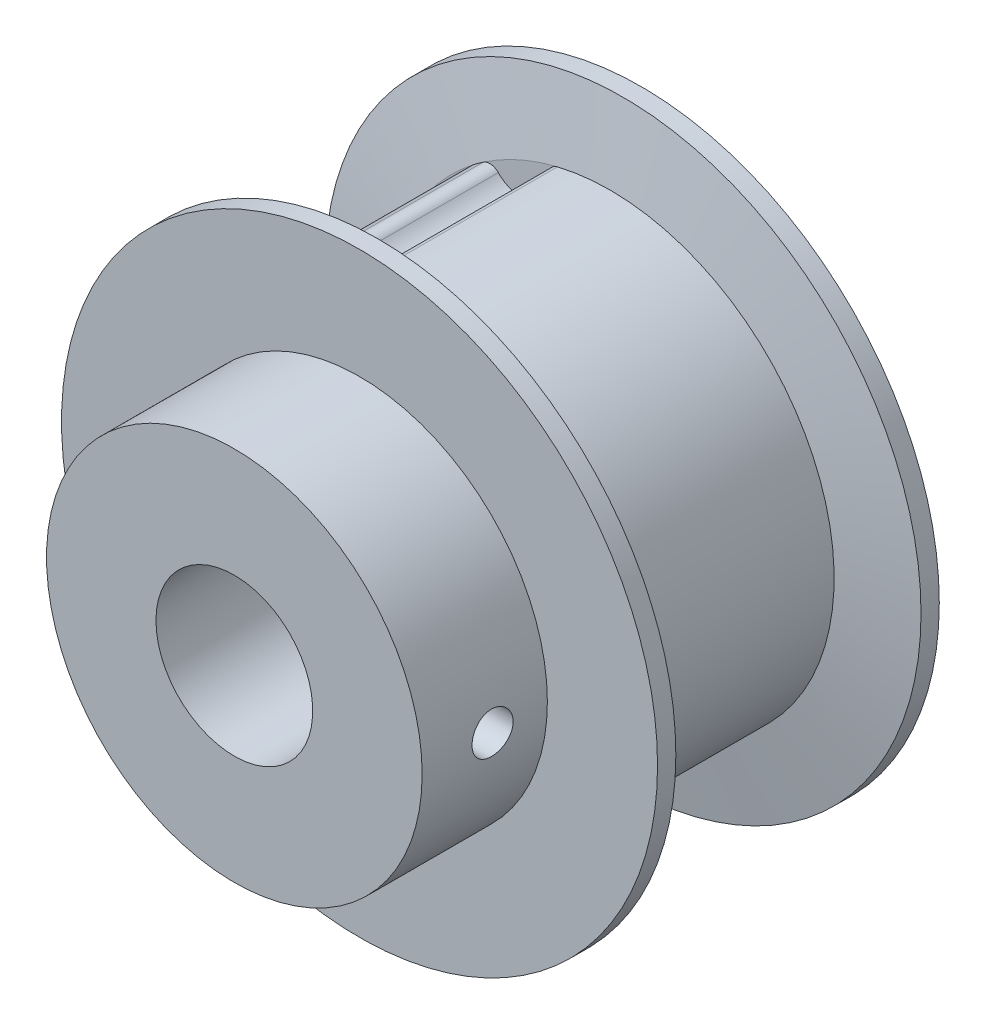
ISO-10303-21;
HEADER;
FILE_DESCRIPTION(('STEP AP214'),'2;1');
FILE_NAME('part.step','',(''),(''),'','','');
FILE_SCHEMA(('AUTOMOTIVE_DESIGN { 1 0 10303 214 1 1 1 1 }'));
ENDSEC;
DATA;
#1=APPLICATION_CONTEXT('core data for automotive mechanical design processes');
#2=APPLICATION_PROTOCOL_DEFINITION('international standard','automotive_design',2000,#1);
#3=PRODUCT_CONTEXT('',#1,'mechanical');
#4=PRODUCT('Part','Part','',(#3));
#5=PRODUCT_RELATED_PRODUCT_CATEGORY('part','',(#4));
#6=PRODUCT_DEFINITION_FORMATION('','',#4);
#7=PRODUCT_DEFINITION_CONTEXT('part definition',#1,'design');
#8=PRODUCT_DEFINITION('design','',#6,#7);
#9=PRODUCT_DEFINITION_SHAPE('','',#8);
#10=(LENGTH_UNIT() NAMED_UNIT(*) SI_UNIT(.MILLI.,.METRE.));
#11=(NAMED_UNIT(*) PLANE_ANGLE_UNIT() SI_UNIT($,.RADIAN.));
#12=(NAMED_UNIT(*) SI_UNIT($,.STERADIAN.) SOLID_ANGLE_UNIT());
#13=UNCERTAINTY_MEASURE_WITH_UNIT(LENGTH_MEASURE(1.E-05),#10,'distance_accuracy_value','');
#14=(GEOMETRIC_REPRESENTATION_CONTEXT(3) GLOBAL_UNCERTAINTY_ASSIGNED_CONTEXT((#13)) GLOBAL_UNIT_ASSIGNED_CONTEXT((#10,
#11,#12)) REPRESENTATION_CONTEXT('',''));
#15=CARTESIAN_POINT('',(0.,0.,0.));
#16=DIRECTION('',(0.,0.,1.));
#17=DIRECTION('',(1.,0.,0.));
#18=AXIS2_PLACEMENT_3D('',#15,#16,#17);
#19=CARTESIAN_POINT('',(0.,0.,-6.83854493654546));
#20=DIRECTION('',(0.,0.,1.));
#21=DIRECTION('',(1.,0.,0.));
#22=AXIS2_PLACEMENT_3D('',#19,#20,#21);
#23=CYLINDRICAL_SURFACE('',#22,11.3665);
#24=DIRECTION('',(0.,0.,1.));
#25=VECTOR('',#24,1.);
#26=CARTESIAN_POINT('',(-6.92571975920571,9.01286458718603,5.55625));
#27=LINE('',#26,#25);
#28=CARTESIAN_POINT('',(-6.92571975985629,9.0128645866861,5.55624999999923));
#29=VERTEX_POINT('',#28);
#30=CARTESIAN_POINT('',(-6.92571975985654,9.01286458668643,-5.55624999999925));
#31=VERTEX_POINT('',#30);
#32=EDGE_CURVE('E222',#29,#31,#27,.F.);
#33=ORIENTED_EDGE('',*,*,#32,.F.);
#34=CARTESIAN_POINT('',(0.,0.,5.55625));
#35=DIRECTION('',(0.,0.,1.));
#36=DIRECTION('',(1.,0.,0.));
#37=AXIS2_PLACEMENT_3D('',#34,#35,#36);
#38=CIRCLE('',#37,11.3665);
#39=CARTESIAN_POINT('',(-6.43157849157934,9.37187923293224,5.55625000000005));
#40=VERTEX_POINT('',#39);
#41=EDGE_CURVE('E240',#29,#40,#38,.F.);
#42=ORIENTED_EDGE('',*,*,#41,.T.);
#43=DIRECTION('',(0.,0.,1.));
#44=VECTOR('',#43,1.);
#45=CARTESIAN_POINT('',(-6.43157849225601,9.37187923246853,5.55625));
#46=LINE('',#45,#44);
#47=CARTESIAN_POINT('',(-6.43157849157945,9.3718792329324,-5.5562499999992));
#48=VERTEX_POINT('',#47);
#49=EDGE_CURVE('E219',#48,#40,#46,.T.);
#50=ORIENTED_EDGE('',*,*,#49,.F.);
#51=CARTESIAN_POINT('',(0.,0.,-5.55625));
#52=DIRECTION('',(0.,0.,1.));
#53=DIRECTION('',(1.,0.,0.));
#54=AXIS2_PLACEMENT_3D('',#51,#52,#53);
#55=CIRCLE('',#54,11.3665);
#56=EDGE_CURVE('E243',#48,#31,#55,.T.);
#57=ORIENTED_EDGE('',*,*,#56,.T.);
#58=EDGE_LOOP('',(#33,#42,#50,#57));
#59=FACE_BOUND('',#58,.T.);
#60=ADVANCED_FACE('F16',(#59),#23,.T.);
#61=CARTESIAN_POINT('',(0.,0.,-6.83854493654546));
#62=DIRECTION('',(0.,0.,1.));
#63=DIRECTION('',(1.,0.,0.));
#64=AXIS2_PLACEMENT_3D('',#61,#62,#63);
#65=CYLINDRICAL_SURFACE('',#64,11.3665);
#66=CARTESIAN_POINT('',(0.,0.,-5.55625));
#67=DIRECTION('',(0.,0.,1.));
#68=DIRECTION('',(1.,0.,0.));
#69=AXIS2_PLACEMENT_3D('',#66,#67,#68);
#70=CIRCLE('',#69,11.3665);
#71=CARTESIAN_POINT('',(-9.68742601496993,5.94567905747549,-5.55624999999925));
#72=VERTEX_POINT('',#71);
#73=CARTESIAN_POINT('',(-9.99282211400751,5.41671749750633,-5.55624999999916));
#74=VERTEX_POINT('',#73);
#75=EDGE_CURVE('E235',#72,#74,#70,.T.);
#76=ORIENTED_EDGE('',*,*,#75,.T.);
#77=DIRECTION('',(0.,0.,1.));
#78=VECTOR('',#77,1.);
#79=CARTESIAN_POINT('',(-9.99282211361638,5.41671749822686,5.55625));
#80=LINE('',#79,#78);
#81=CARTESIAN_POINT('',(-9.99282211400708,5.4167174975061,5.5562499999992));
#82=VERTEX_POINT('',#81);
#83=EDGE_CURVE('E211',#82,#74,#80,.F.);
#84=ORIENTED_EDGE('',*,*,#83,.F.);
#85=CARTESIAN_POINT('',(0.,0.,5.55625));
#86=DIRECTION('',(0.,0.,1.));
#87=DIRECTION('',(1.,0.,0.));
#88=AXIS2_PLACEMENT_3D('',#85,#86,#87);
#89=CIRCLE('',#88,11.3665);
#90=CARTESIAN_POINT('',(-9.68742601496977,5.94567905747539,5.55624999999923));
#91=VERTEX_POINT('',#90);
#92=EDGE_CURVE('E242',#82,#91,#89,.F.);
#93=ORIENTED_EDGE('',*,*,#92,.T.);
#94=DIRECTION('',(0.,0.,1.));
#95=VECTOR('',#94,1.);
#96=CARTESIAN_POINT('',(-9.68742601539869,5.94567905677654,5.55625));
#97=LINE('',#96,#95);
#98=EDGE_CURVE('E228',#72,#91,#97,.T.);
#99=ORIENTED_EDGE('',*,*,#98,.F.);
#100=EDGE_LOOP('',(#76,#84,#93,#99));
#101=FACE_BOUND('',#100,.T.);
#102=ADVANCED_FACE('F341',(#101),#65,.T.);
#103=CARTESIAN_POINT('',(-9.17653606159526,5.63211922404484,5.55625));
#104=DIRECTION('',(0.,0.,1.));
#105=DIRECTION('',(1.,0.,0.));
#106=AXIS2_PLACEMENT_3D('',#103,#104,#105);
#107=CYLINDRICAL_SURFACE('',#106,0.59944);
#108=CARTESIAN_POINT('',(-9.17653606159526,5.63211922404484,-5.55625));
#109=DIRECTION('',(0.,0.,1.));
#110=DIRECTION('',(1.,0.,0.));
#111=AXIS2_PLACEMENT_3D('',#108,#109,#110);
#112=CIRCLE('',#111,0.59944);
#113=CARTESIAN_POINT('',(-8.9552052355263,6.18920178438181,-5.55625));
#114=VERTEX_POINT('',#113);
#115=EDGE_CURVE('E19',#114,#72,#112,.T.);
#116=ORIENTED_EDGE('',*,*,#115,.T.);
#117=ORIENTED_EDGE('',*,*,#98,.T.);
#118=CARTESIAN_POINT('',(-9.17653606159526,5.63211922404484,5.55625));
#119=DIRECTION('',(0.,0.,1.));
#120=DIRECTION('',(1.,0.,0.));
#121=AXIS2_PLACEMENT_3D('',#118,#119,#120);
#122=CIRCLE('',#121,0.59944);
#123=CARTESIAN_POINT('',(-8.9552052355263,6.18920178438181,5.55625));
#124=VERTEX_POINT('',#123);
#125=EDGE_CURVE('E215',#91,#124,#122,.F.);
#126=ORIENTED_EDGE('',*,*,#125,.T.);
#127=DIRECTION('',(0.,0.,1.));
#128=VECTOR('',#127,1.);
#129=CARTESIAN_POINT('',(-8.95520523552598,6.18920178438165,5.55625));
#130=LINE('',#129,#128);
#131=EDGE_CURVE('E202',#124,#114,#130,.F.);
#132=ORIENTED_EDGE('',*,*,#131,.T.);
#133=EDGE_LOOP('',(#116,#117,#126,#132));
#134=FACE_BOUND('',#133,.T.);
#135=ADVANCED_FACE('F332',(#134),#107,.T.);
#136=CARTESIAN_POINT('',(-6.5604750982768,8.53754926946218,5.55625));
#137=DIRECTION('',(0.,0.,1.));
#138=DIRECTION('',(1.,0.,0.));
#139=AXIS2_PLACEMENT_3D('',#136,#137,#138);
#140=CYLINDRICAL_SURFACE('',#139,0.59944);
#141=DIRECTION('',(0.,0.,1.));
#142=VECTOR('',#141,1.);
#143=CARTESIAN_POINT('',(-7.09137053093834,8.25919993287166,5.55625));
#144=LINE('',#143,#142);
#145=CARTESIAN_POINT('',(-7.09137053093783,8.25919993287182,-5.55625));
#146=VERTEX_POINT('',#145);
#147=CARTESIAN_POINT('',(-7.09137053093783,8.25919993287182,5.55625));
#148=VERTEX_POINT('',#147);
#149=EDGE_CURVE('E197',#146,#148,#144,.T.);
#150=ORIENTED_EDGE('',*,*,#149,.T.);
#151=CARTESIAN_POINT('',(-6.5604750982768,8.53754926946218,5.55625));
#152=DIRECTION('',(0.,0.,1.));
#153=DIRECTION('',(1.,0.,0.));
#154=AXIS2_PLACEMENT_3D('',#151,#152,#153);
#155=CIRCLE('',#154,0.59944);
#156=EDGE_CURVE('E212',#148,#29,#155,.F.);
#157=ORIENTED_EDGE('',*,*,#156,.T.);
#158=ORIENTED_EDGE('',*,*,#32,.T.);
#159=CARTESIAN_POINT('',(-6.5604750982768,8.53754926946218,-5.55625));
#160=DIRECTION('',(0.,0.,1.));
#161=DIRECTION('',(1.,0.,0.));
#162=AXIS2_PLACEMENT_3D('',#159,#160,#161);
#163=CIRCLE('',#162,0.59944);
#164=EDGE_CURVE('E221',#31,#146,#163,.T.);
#165=ORIENTED_EDGE('',*,*,#164,.T.);
#166=EDGE_LOOP('',(#150,#157,#158,#165));
#167=FACE_BOUND('',#166,.T.);
#168=ADVANCED_FACE('F347',(#167),#140,.T.);
#169=CARTESIAN_POINT('',(-6.09239356937188,8.87763040678648,5.55625));
#170=DIRECTION('',(0.,0.,1.));
#171=DIRECTION('',(1.,0.,0.));
#172=AXIS2_PLACEMENT_3D('',#169,#170,#171);
#173=CYLINDRICAL_SURFACE('',#172,0.59944);
#174=CARTESIAN_POINT('',(-6.09239356937188,8.87763040678648,-5.55625));
#175=DIRECTION('',(0.,0.,1.));
#176=DIRECTION('',(1.,0.,0.));
#177=AXIS2_PLACEMENT_3D('',#174,#175,#176);
#178=CIRCLE('',#177,0.59944);
#179=CARTESIAN_POINT('',(-5.66361190807295,9.29652729210982,-5.55625));
#180=VERTEX_POINT('',#179);
#181=EDGE_CURVE('E220',#180,#48,#178,.T.);
#182=ORIENTED_EDGE('',*,*,#181,.T.);
#183=ORIENTED_EDGE('',*,*,#49,.T.);
#184=CARTESIAN_POINT('',(-6.09239356937188,8.87763040678648,5.55625));
#185=DIRECTION('',(0.,0.,1.));
#186=DIRECTION('',(1.,0.,0.));
#187=AXIS2_PLACEMENT_3D('',#184,#185,#186);
#188=CIRCLE('',#187,0.59944);
#189=CARTESIAN_POINT('',(-5.66361190807295,9.29652729210982,5.55625));
#190=VERTEX_POINT('',#189);
#191=EDGE_CURVE('E217',#40,#190,#188,.F.);
#192=ORIENTED_EDGE('',*,*,#191,.T.);
#193=DIRECTION('',(0.,0.,1.));
#194=VECTOR('',#193,1.);
#195=CARTESIAN_POINT('',(-5.66361190807289,9.29652729210959,5.55625));
#196=LINE('',#195,#194);
#197=EDGE_CURVE('E193',#190,#180,#196,.F.);
#198=ORIENTED_EDGE('',*,*,#197,.T.);
#199=EDGE_LOOP('',(#182,#183,#192,#198));
#200=FACE_BOUND('',#199,.T.);
#201=ADVANCED_FACE('F353',(#200),#173,.T.);
#202=CARTESIAN_POINT('',(0.,0.,5.55625));
#203=DIRECTION('',(0.,0.,1.));
#204=DIRECTION('',(1.,0.,0.));
#205=AXIS2_PLACEMENT_3D('',#202,#203,#204);
#206=PLANE('',#205);
#207=CARTESIAN_POINT('',(-4.81474897364002,10.3207619131949,5.55625));
#208=DIRECTION('',(0.,0.,1.));
#209=DIRECTION('',(1.,0.,0.));
#210=AXIS2_PLACEMENT_3D('',#207,#208,#209);
#211=CIRCLE('',#210,1.69926);
#212=CARTESIAN_POINT('',(-3.11897008181064,10.4294748269975,5.55625));
#213=VERTEX_POINT('',#212);
#214=CARTESIAN_POINT('',(-3.94512141991133,8.86088778663605,5.55625));
#215=VERTEX_POINT('',#214);
#216=EDGE_CURVE('E189',#213,#215,#211,.F.);
#217=ORIENTED_EDGE('',*,*,#216,.T.);
#218=CARTESIAN_POINT('',(-4.4481249105777,10.4839934627941,5.55625));
#219=DIRECTION('',(0.,0.,1.));
#220=DIRECTION('',(1.,0.,0.));
#221=AXIS2_PLACEMENT_3D('',#218,#219,#220);
#222=CIRCLE('',#221,1.69926);
#223=EDGE_CURVE('E194',#215,#190,#222,.F.);
#224=ORIENTED_EDGE('',*,*,#223,.T.);
#225=ORIENTED_EDGE('',*,*,#191,.F.);
#226=CARTESIAN_POINT('',(0.,0.,5.55624999999832));
#227=DIRECTION('',(0.,0.,1.));
#228=DIRECTION('',(1.,0.,0.));
#229=AXIS2_PLACEMENT_3D('',#226,#227,#228);
#230=CIRCLE('',#229,11.3665000000005);
#231=CARTESIAN_POINT('',(-2.66109754103617,11.0506055095227,5.55624999999921));
#232=VERTEX_POINT('',#231);
#233=EDGE_CURVE('E181',#232,#40,#230,.T.);
#234=ORIENTED_EDGE('',*,*,#233,.F.);
#235=CARTESIAN_POINT('',(-2.52075809605285,10.4678249729721,5.55625));
#236=DIRECTION('',(0.,0.,1.));
#237=DIRECTION('',(1.,0.,0.));
#238=AXIS2_PLACEMENT_3D('',#235,#236,#237);
#239=CIRCLE('',#238,0.59944);
#240=EDGE_CURVE('E185',#213,#232,#239,.F.);
#241=ORIENTED_EDGE('',*,*,#240,.F.);
#242=EDGE_LOOP('',(#217,#224,#225,#234,#241));
#243=FACE_BOUND('',#242,.T.);
#244=ADVANCED_FACE('F356',(#243),#206,.F.);
#245=CARTESIAN_POINT('',(0.,0.,5.55625));
#246=DIRECTION('',(0.,0.,1.));
#247=DIRECTION('',(1.,0.,0.));
#248=AXIS2_PLACEMENT_3D('',#245,#246,#247);
#249=PLANE('',#248);
#250=CARTESIAN_POINT('',(-8.59632410911572,7.47015033041876,5.55625));
#251=DIRECTION('',(0.,0.,1.));
#252=DIRECTION('',(1.,0.,0.));
#253=AXIS2_PLACEMENT_3D('',#250,#251,#252);
#254=CIRCLE('',#253,1.69926);
#255=CARTESIAN_POINT('',(-7.20809550601794,6.49019834529848,5.55625));
#256=VERTEX_POINT('',#255);
#257=EDGE_CURVE('E198',#148,#256,#254,.F.);
#258=ORIENTED_EDGE('',*,*,#257,.T.);
#259=CARTESIAN_POINT('',(-8.32778861417102,7.76838921177826,5.55625));
#260=DIRECTION('',(0.,0.,1.));
#261=DIRECTION('',(1.,0.,0.));
#262=AXIS2_PLACEMENT_3D('',#259,#260,#261);
#263=CIRCLE('',#262,1.69926);
#264=EDGE_CURVE('E203',#256,#124,#263,.F.);
#265=ORIENTED_EDGE('',*,*,#264,.T.);
#266=ORIENTED_EDGE('',*,*,#125,.F.);
#267=CARTESIAN_POINT('',(0.,0.,5.55624999999837));
#268=DIRECTION('',(0.,0.,1.));
#269=DIRECTION('',(1.,0.,0.));
#270=AXIS2_PLACEMENT_3D('',#267,#268,#269);
#271=CIRCLE('',#270,11.3665000000008);
#272=EDGE_CURVE('E178',#29,#91,#271,.T.);
#273=ORIENTED_EDGE('',*,*,#272,.F.);
#274=ORIENTED_EDGE('',*,*,#156,.F.);
#275=EDGE_LOOP('',(#258,#265,#266,#273,#274));
#276=FACE_BOUND('',#275,.T.);
#277=ADVANCED_FACE('F360',(#276),#249,.F.);
#278=CARTESIAN_POINT('',(0.,0.,5.55625));
#279=DIRECTION('',(0.,0.,1.));
#280=DIRECTION('',(1.,0.,0.));
#281=AXIS2_PLACEMENT_3D('',#278,#279,#280);
#282=PLANE('',#281);
#283=CARTESIAN_POINT('',(-10.8915167109718,3.32788189132984,5.55625));
#284=DIRECTION('',(0.,0.,1.));
#285=DIRECTION('',(1.,0.,0.));
#286=AXIS2_PLACEMENT_3D('',#283,#284,#285);
#287=CIRCLE('',#286,1.69926);
#288=CARTESIAN_POINT('',(-9.83760859218593,4.66083433787746,5.55625));
#289=VERTEX_POINT('',#288);
#290=CARTESIAN_POINT('',(-9.22472439563864,2.99729464846287,5.55625));
#291=VERTEX_POINT('',#290);
#292=EDGE_CURVE('E141',#289,#291,#287,.F.);
#293=ORIENTED_EDGE('',*,*,#292,.T.);
#294=CARTESIAN_POINT('',(-10.7675020107898,3.7095598924478,5.55625));
#295=DIRECTION('',(0.,0.,1.));
#296=DIRECTION('',(1.,0.,0.));
#297=AXIS2_PLACEMENT_3D('',#294,#295,#296);
#298=CIRCLE('',#297,1.69926);
#299=CARTESIAN_POINT('',(-10.6983622222705,2.01170706100379,5.55625));
#300=VERTEX_POINT('',#299);
#301=EDGE_CURVE('E119',#291,#300,#298,.F.);
#302=ORIENTED_EDGE('',*,*,#301,.T.);
#303=CARTESIAN_POINT('',(-10.6739721025541,1.41276346127185,5.55625));
#304=DIRECTION('',(0.,0.,1.));
#305=DIRECTION('',(1.,0.,0.));
#306=AXIS2_PLACEMENT_3D('',#303,#304,#305);
#307=CIRCLE('',#306,0.59944);
#308=CARTESIAN_POINT('',(-11.2682295728675,1.49141695818421,5.5562499999992));
#309=VERTEX_POINT('',#308);
#310=EDGE_CURVE('E136',#309,#300,#307,.F.);
#311=ORIENTED_EDGE('',*,*,#310,.F.);
#312=CARTESIAN_POINT('',(0.,0.,5.5562499999983));
#313=DIRECTION('',(0.,0.,1.));
#314=DIRECTION('',(1.,0.,0.));
#315=AXIS2_PLACEMENT_3D('',#312,#313,#314);
#316=CIRCLE('',#315,11.3665000000004);
#317=EDGE_CURVE('E176',#82,#309,#316,.T.);
#318=ORIENTED_EDGE('',*,*,#317,.F.);
#319=CARTESIAN_POINT('',(-9.46582635596246,5.13105373606098,5.55625));
#320=DIRECTION('',(0.,0.,1.));
#321=DIRECTION('',(1.,0.,0.));
#322=AXIS2_PLACEMENT_3D('',#319,#320,#321);
#323=CIRCLE('',#322,0.59944);
#324=EDGE_CURVE('E206',#289,#82,#323,.F.);
#325=ORIENTED_EDGE('',*,*,#324,.F.);
#326=EDGE_LOOP('',(#293,#302,#311,#318,#325));
#327=FACE_BOUND('',#326,.T.);
#328=ADVANCED_FACE('F364',(#327),#282,.F.);
#329=CARTESIAN_POINT('',(-9.46582635596246,5.13105373606098,5.55625));
#330=DIRECTION('',(0.,0.,1.));
#331=DIRECTION('',(1.,0.,0.));
#332=AXIS2_PLACEMENT_3D('',#329,#330,#331);
#333=CYLINDRICAL_SURFACE('',#332,0.59944);
#334=DIRECTION('',(0.,0.,1.));
#335=VECTOR('',#334,1.);
#336=CARTESIAN_POINT('',(-9.83760859218621,4.66083433787767,5.55625));
#337=LINE('',#336,#335);
#338=CARTESIAN_POINT('',(-9.83760859218609,4.66083433787726,-5.55625));
#339=VERTEX_POINT('',#338);
#340=EDGE_CURVE('E171',#339,#289,#337,.T.);
#341=ORIENTED_EDGE('',*,*,#340,.T.);
#342=ORIENTED_EDGE('',*,*,#324,.T.);
#343=ORIENTED_EDGE('',*,*,#83,.T.);
#344=CARTESIAN_POINT('',(-9.46582635596246,5.13105373606098,-5.55625));
#345=DIRECTION('',(0.,0.,1.));
#346=DIRECTION('',(1.,0.,0.));
#347=AXIS2_PLACEMENT_3D('',#344,#345,#346);
#348=CIRCLE('',#347,0.59944);
#349=EDGE_CURVE('E209',#74,#339,#348,.T.);
#350=ORIENTED_EDGE('',*,*,#349,.T.);
#351=EDGE_LOOP('',(#341,#342,#343,#350));
#352=FACE_BOUND('',#351,.T.);
#353=ADVANCED_FACE('F368',(#352),#333,.T.);
#354=CARTESIAN_POINT('',(0.,0.,-7.14375));
#355=DIRECTION('',(0.,0.,1.));
#356=DIRECTION('',(1.,0.,0.));
#357=AXIS2_PLACEMENT_3D('',#354,#355,#356);
#358=CYLINDRICAL_SURFACE('',#357,15.113);
#359=CARTESIAN_POINT('',(0.,0.,7.14375));
#360=DIRECTION('',(0.,0.,1.));
#361=DIRECTION('',(1.,0.,0.));
#362=AXIS2_PLACEMENT_3D('',#359,#360,#361);
#363=CIRCLE('',#362,15.113);
#364=CARTESIAN_POINT('',(15.113,0.,7.14375));
#365=VERTEX_POINT('',#364);
#366=EDGE_CURVE('E168',#365,#365,#363,.T.);
#367=ORIENTED_EDGE('',*,*,#366,.F.);
#368=EDGE_LOOP('',(#367));
#369=FACE_BOUND('',#368,.T.);
#370=CARTESIAN_POINT('',(0.,0.,6.21685903322354));
#371=DIRECTION('',(0.,0.,1.));
#372=DIRECTION('',(0.,1.,0.));
#373=AXIS2_PLACEMENT_3D('',#370,#371,#372);
#374=CIRCLE('',#373,15.1130000000001);
#375=CARTESIAN_POINT('',(0.,15.1130000000001,6.21685903322354));
#376=VERTEX_POINT('',#375);
#377=EDGE_CURVE('E184',#376,#376,#374,.F.);
#378=ORIENTED_EDGE('',*,*,#377,.F.);
#379=EDGE_LOOP('',(#378));
#380=FACE_BOUND('',#379,.T.);
#381=ADVANCED_FACE('F372',(#369,#380),#358,.T.);
#382=CARTESIAN_POINT('',(-8.32778861417102,7.76838921177826,5.55625));
#383=DIRECTION('',(0.,0.,1.));
#384=DIRECTION('',(1.,0.,0.));
#385=AXIS2_PLACEMENT_3D('',#382,#383,#384);
#386=CYLINDRICAL_SURFACE('',#385,1.69926);
#387=CARTESIAN_POINT('',(-8.32778861417102,7.76838921177826,-5.55625));
#388=DIRECTION('',(0.,0.,1.));
#389=DIRECTION('',(1.,0.,0.));
#390=AXIS2_PLACEMENT_3D('',#387,#388,#389);
#391=CIRCLE('',#390,1.69926);
#392=CARTESIAN_POINT('',(-7.20809550601794,6.49019834529848,-5.55625));
#393=VERTEX_POINT('',#392);
#394=EDGE_CURVE('E166',#114,#393,#391,.T.);
#395=ORIENTED_EDGE('',*,*,#394,.F.);
#396=ORIENTED_EDGE('',*,*,#131,.F.);
#397=ORIENTED_EDGE('',*,*,#264,.F.);
#398=DIRECTION('',(0.,0.,1.));
#399=VECTOR('',#398,1.);
#400=CARTESIAN_POINT('',(-7.20809550601637,6.49019834530069,5.55625));
#401=LINE('',#400,#399);
#402=EDGE_CURVE('E201',#256,#393,#401,.F.);
#403=ORIENTED_EDGE('',*,*,#402,.T.);
#404=EDGE_LOOP('',(#395,#396,#397,#403));
#405=FACE_BOUND('',#404,.T.);
#406=ADVANCED_FACE('F376',(#405),#386,.F.);
#407=CARTESIAN_POINT('',(-8.59632410911572,7.47015033041876,5.55625));
#408=DIRECTION('',(0.,0.,1.));
#409=DIRECTION('',(1.,0.,0.));
#410=AXIS2_PLACEMENT_3D('',#407,#408,#409);
#411=CYLINDRICAL_SURFACE('',#410,1.69926);
#412=CARTESIAN_POINT('',(-8.59632410911572,7.47015033041876,-5.55625));
#413=DIRECTION('',(0.,0.,1.));
#414=DIRECTION('',(1.,0.,0.));
#415=AXIS2_PLACEMENT_3D('',#412,#413,#414);
#416=CIRCLE('',#415,1.69926);
#417=EDGE_CURVE('E163',#393,#146,#416,.T.);
#418=ORIENTED_EDGE('',*,*,#417,.F.);
#419=ORIENTED_EDGE('',*,*,#402,.F.);
#420=ORIENTED_EDGE('',*,*,#257,.F.);
#421=ORIENTED_EDGE('',*,*,#149,.F.);
#422=EDGE_LOOP('',(#418,#419,#420,#421));
#423=FACE_BOUND('',#422,.T.);
#424=ADVANCED_FACE('F380',(#423),#411,.F.);
#425=CARTESIAN_POINT('',(-4.4481249105777,10.4839934627941,5.55625));
#426=DIRECTION('',(0.,0.,1.));
#427=DIRECTION('',(1.,0.,0.));
#428=AXIS2_PLACEMENT_3D('',#425,#426,#427);
#429=CYLINDRICAL_SURFACE('',#428,1.69926);
#430=CARTESIAN_POINT('',(-4.4481249105777,10.4839934627941,-5.55625));
#431=DIRECTION('',(0.,0.,1.));
#432=DIRECTION('',(1.,0.,0.));
#433=AXIS2_PLACEMENT_3D('',#430,#431,#432);
#434=CIRCLE('',#433,1.69926);
#435=CARTESIAN_POINT('',(-3.94512141991133,8.86088778663605,-5.55625));
#436=VERTEX_POINT('',#435);
#437=EDGE_CURVE('E161',#180,#436,#434,.T.);
#438=ORIENTED_EDGE('',*,*,#437,.F.);
#439=ORIENTED_EDGE('',*,*,#197,.F.);
#440=ORIENTED_EDGE('',*,*,#223,.F.);
#441=DIRECTION('',(0.,0.,1.));
#442=VECTOR('',#441,1.);
#443=CARTESIAN_POINT('',(-3.94512141991031,8.86088778663666,5.55625));
#444=LINE('',#443,#442);
#445=EDGE_CURVE('E192',#215,#436,#444,.F.);
#446=ORIENTED_EDGE('',*,*,#445,.T.);
#447=EDGE_LOOP('',(#438,#439,#440,#446));
#448=FACE_BOUND('',#447,.T.);
#449=ADVANCED_FACE('F384',(#448),#429,.F.);
#450=CARTESIAN_POINT('',(-4.81474897364002,10.3207619131949,5.55625));
#451=DIRECTION('',(0.,0.,1.));
#452=DIRECTION('',(1.,0.,0.));
#453=AXIS2_PLACEMENT_3D('',#450,#451,#452);
#454=CYLINDRICAL_SURFACE('',#453,1.69926);
#455=CARTESIAN_POINT('',(-4.81474897364002,10.3207619131949,-5.55625));
#456=DIRECTION('',(0.,0.,1.));
#457=DIRECTION('',(1.,0.,0.));
#458=AXIS2_PLACEMENT_3D('',#455,#456,#457);
#459=CIRCLE('',#458,1.69926);
#460=CARTESIAN_POINT('',(-3.11897008181064,10.4294748269975,-5.55625));
#461=VERTEX_POINT('',#460);
#462=EDGE_CURVE('E159',#436,#461,#459,.T.);
#463=ORIENTED_EDGE('',*,*,#462,.F.);
#464=ORIENTED_EDGE('',*,*,#445,.F.);
#465=ORIENTED_EDGE('',*,*,#216,.F.);
#466=DIRECTION('',(0.,0.,1.));
#467=VECTOR('',#466,1.);
#468=CARTESIAN_POINT('',(-3.11897008181021,10.429474826998,5.55625));
#469=LINE('',#468,#467);
#470=EDGE_CURVE('E188',#461,#213,#469,.T.);
#471=ORIENTED_EDGE('',*,*,#470,.F.);
#472=EDGE_LOOP('',(#463,#464,#465,#471));
#473=FACE_BOUND('',#472,.T.);
#474=ADVANCED_FACE('F388',(#473),#454,.F.);
#475=CARTESIAN_POINT('',(-2.52075809605285,10.4678249729721,5.55625));
#476=DIRECTION('',(0.,0.,1.));
#477=DIRECTION('',(1.,0.,0.));
#478=AXIS2_PLACEMENT_3D('',#475,#476,#477);
#479=CYLINDRICAL_SURFACE('',#478,0.59944);
#480=ORIENTED_EDGE('',*,*,#240,.T.);
#481=DIRECTION('',(0.,0.,1.));
#482=VECTOR('',#481,1.);
#483=CARTESIAN_POINT('',(-2.66109754023772,11.0506055097149,-6.83854493654546));
#484=LINE('',#483,#482);
#485=CARTESIAN_POINT('',(-2.66109754103616,11.0506055095227,-5.5562499999992));
#486=VERTEX_POINT('',#485);
#487=EDGE_CURVE('E158',#486,#232,#484,.T.);
#488=ORIENTED_EDGE('',*,*,#487,.F.);
#489=CARTESIAN_POINT('',(-2.52075809605285,10.4678249729721,-5.55625));
#490=DIRECTION('',(0.,0.,1.));
#491=DIRECTION('',(1.,0.,0.));
#492=AXIS2_PLACEMENT_3D('',#489,#490,#491);
#493=CIRCLE('',#492,0.59944);
#494=EDGE_CURVE('E155',#461,#486,#493,.F.);
#495=ORIENTED_EDGE('',*,*,#494,.F.);
#496=ORIENTED_EDGE('',*,*,#470,.T.);
#497=EDGE_LOOP('',(#480,#488,#495,#496));
#498=FACE_BOUND('',#497,.T.);
#499=ADVANCED_FACE('F392',(#498),#479,.T.);
#500=CARTESIAN_POINT('',(0.,0.,6.21685903322354));
#501=DIRECTION('',(0.,0.,1.));
#502=DIRECTION('',(1.,0.,0.));
#503=AXIS2_PLACEMENT_3D('',#500,#501,#502);
#504=CONICAL_SURFACE('',#503,15.1130000000001,1.3962634015952);
#505=ORIENTED_EDGE('',*,*,#377,.T.);
#506=EDGE_LOOP('',(#505));
#507=FACE_BOUND('',#506,.T.);
#508=ORIENTED_EDGE('',*,*,#92,.F.);
#509=ORIENTED_EDGE('',*,*,#317,.T.);
#510=CARTESIAN_POINT('',(0.,0.,5.55625));
#511=DIRECTION('',(0.,0.,1.));
#512=DIRECTION('',(1.,0.,0.));
#513=AXIS2_PLACEMENT_3D('',#510,#511,#512);
#514=CIRCLE('',#513,11.3665);
#515=EDGE_CURVE('E151',#232,#309,#514,.F.);
#516=ORIENTED_EDGE('',*,*,#515,.F.);
#517=ORIENTED_EDGE('',*,*,#233,.T.);
#518=ORIENTED_EDGE('',*,*,#41,.F.);
#519=ORIENTED_EDGE('',*,*,#272,.T.);
#520=EDGE_LOOP('',(#508,#509,#516,#517,#518,#519));
#521=FACE_BOUND('',#520,.T.);
#522=ADVANCED_FACE('F396',(#507,#521),#504,.T.);
#523=CARTESIAN_POINT('',(-10.6739721025541,1.41276346127185,5.55625));
#524=DIRECTION('',(0.,0.,1.));
#525=DIRECTION('',(1.,0.,0.));
#526=AXIS2_PLACEMENT_3D('',#523,#524,#525);
#527=CYLINDRICAL_SURFACE('',#526,0.59944);
#528=CARTESIAN_POINT('',(-10.6739721025541,1.41276346127185,-5.55625));
#529=DIRECTION('',(0.,0.,1.));
#530=DIRECTION('',(1.,0.,0.));
#531=AXIS2_PLACEMENT_3D('',#528,#529,#530);
#532=CIRCLE('',#531,0.59944);
#533=CARTESIAN_POINT('',(-10.6983622222705,2.01170706100379,-5.55625));
#534=VERTEX_POINT('',#533);
#535=CARTESIAN_POINT('',(-11.2682295728676,1.49141695818423,-5.55624999999919));
#536=VERTEX_POINT('',#535);
#537=EDGE_CURVE('E34',#534,#536,#532,.T.);
#538=ORIENTED_EDGE('',*,*,#537,.T.);
#539=DIRECTION('',(0.,0.,1.));
#540=VECTOR('',#539,1.);
#541=CARTESIAN_POINT('',(-11.2682295729749,1.49141695737067,-6.83854493654546));
#542=LINE('',#541,#540);
#543=EDGE_CURVE('E147',#309,#536,#542,.F.);
#544=ORIENTED_EDGE('',*,*,#543,.F.);
#545=ORIENTED_EDGE('',*,*,#310,.T.);
#546=DIRECTION('',(0.,0.,1.));
#547=VECTOR('',#546,1.);
#548=CARTESIAN_POINT('',(-10.6983622222701,2.0117070610035,5.55625));
#549=LINE('',#548,#547);
#550=EDGE_CURVE('E138',#300,#534,#549,.F.);
#551=ORIENTED_EDGE('',*,*,#550,.T.);
#552=EDGE_LOOP('',(#538,#544,#545,#551));
#553=FACE_BOUND('',#552,.T.);
#554=ADVANCED_FACE('F139',(#553),#527,.T.);
#555=CARTESIAN_POINT('',(-10.7675020107898,3.7095598924478,5.55625));
#556=DIRECTION('',(0.,0.,1.));
#557=DIRECTION('',(1.,0.,0.));
#558=AXIS2_PLACEMENT_3D('',#555,#556,#557);
#559=CYLINDRICAL_SURFACE('',#558,1.69926);
#560=CARTESIAN_POINT('',(-10.7675020107898,3.7095598924478,-5.55625));
#561=DIRECTION('',(0.,0.,1.));
#562=DIRECTION('',(1.,0.,0.));
#563=AXIS2_PLACEMENT_3D('',#560,#561,#562);
#564=CIRCLE('',#563,1.69926);
#565=CARTESIAN_POINT('',(-9.22472439563864,2.99729464846287,-5.55625));
#566=VERTEX_POINT('',#565);
#567=EDGE_CURVE('E130',#534,#566,#564,.T.);
#568=ORIENTED_EDGE('',*,*,#567,.F.);
#569=ORIENTED_EDGE('',*,*,#550,.F.);
#570=ORIENTED_EDGE('',*,*,#301,.F.);
#571=DIRECTION('',(0.,0.,1.));
#572=VECTOR('',#571,1.);
#573=CARTESIAN_POINT('',(-9.22472439563877,2.99729464846221,5.55625));
#574=LINE('',#573,#572);
#575=EDGE_CURVE('E144',#291,#566,#574,.F.);
#576=ORIENTED_EDGE('',*,*,#575,.T.);
#577=EDGE_LOOP('',(#568,#569,#570,#576));
#578=FACE_BOUND('',#577,.T.);
#579=ADVANCED_FACE('F143',(#578),#559,.F.);
#580=CARTESIAN_POINT('',(-10.8915167109718,3.32788189132984,5.55625));
#581=DIRECTION('',(0.,0.,1.));
#582=DIRECTION('',(1.,0.,0.));
#583=AXIS2_PLACEMENT_3D('',#580,#581,#582);
#584=CYLINDRICAL_SURFACE('',#583,1.69926);
#585=CARTESIAN_POINT('',(-10.8915167109718,3.32788189132984,-5.55625));
#586=DIRECTION('',(0.,0.,1.));
#587=DIRECTION('',(1.,0.,0.));
#588=AXIS2_PLACEMENT_3D('',#585,#586,#587);
#589=CIRCLE('',#588,1.69926);
#590=EDGE_CURVE('E146',#566,#339,#589,.T.);
#591=ORIENTED_EDGE('',*,*,#590,.F.);
#592=ORIENTED_EDGE('',*,*,#575,.F.);
#593=ORIENTED_EDGE('',*,*,#292,.F.);
#594=ORIENTED_EDGE('',*,*,#340,.F.);
#595=EDGE_LOOP('',(#591,#592,#593,#594));
#596=FACE_BOUND('',#595,.T.);
#597=ADVANCED_FACE('F405',(#596),#584,.F.);
#598=CARTESIAN_POINT('',(0.,0.,7.14375));
#599=DIRECTION('',(0.,0.,1.));
#600=DIRECTION('',(1.,0.,0.));
#601=AXIS2_PLACEMENT_3D('',#598,#599,#600);
#602=PLANE('',#601);
#603=CARTESIAN_POINT('',(0.,0.,7.14375));
#604=DIRECTION('',(0.,0.,1.));
#605=DIRECTION('',(1.,0.,0.));
#606=AXIS2_PLACEMENT_3D('',#603,#604,#605);
#607=CIRCLE('',#606,9.525);
#608=CARTESIAN_POINT('',(9.525,0.,7.14375));
#609=VERTEX_POINT('',#608);
#610=EDGE_CURVE('E149',#609,#609,#607,.T.);
#611=ORIENTED_EDGE('',*,*,#610,.F.);
#612=EDGE_LOOP('',(#611));
#613=FACE_BOUND('',#612,.T.);
#614=ORIENTED_EDGE('',*,*,#366,.T.);
#615=EDGE_LOOP('',(#614));
#616=FACE_BOUND('',#615,.T.);
#617=ADVANCED_FACE('F408',(#613,#616),#602,.T.);
#618=CARTESIAN_POINT('',(0.,0.,-5.55625));
#619=DIRECTION('',(0.,0.,1.));
#620=DIRECTION('',(1.,0.,0.));
#621=AXIS2_PLACEMENT_3D('',#618,#619,#620);
#622=PLANE('',#621);
#623=ORIENTED_EDGE('',*,*,#164,.F.);
#624=CARTESIAN_POINT('',(0.,0.,-5.55624999999842));
#625=DIRECTION('',(0.,0.,-1.));
#626=DIRECTION('',(-1.,0.,0.));
#627=AXIS2_PLACEMENT_3D('',#624,#625,#626);
#628=CIRCLE('',#627,11.366500000001);
#629=EDGE_CURVE('E336',#72,#31,#628,.T.);
#630=ORIENTED_EDGE('',*,*,#629,.F.);
#631=ORIENTED_EDGE('',*,*,#115,.F.);
#632=ORIENTED_EDGE('',*,*,#394,.T.);
#633=ORIENTED_EDGE('',*,*,#417,.T.);
#634=EDGE_LOOP('',(#623,#630,#631,#632,#633));
#635=FACE_BOUND('',#634,.T.);
#636=ADVANCED_FACE('F337',(#635),#622,.T.);
#637=CARTESIAN_POINT('',(0.,0.,-5.55625));
#638=DIRECTION('',(0.,0.,1.));
#639=DIRECTION('',(1.,0.,0.));
#640=AXIS2_PLACEMENT_3D('',#637,#638,#639);
#641=PLANE('',#640);
#642=ORIENTED_EDGE('',*,*,#494,.T.);
#643=CARTESIAN_POINT('',(0.,0.,-5.55624999999831));
#644=DIRECTION('',(0.,0.,-1.));
#645=DIRECTION('',(-1.,0.,0.));
#646=AXIS2_PLACEMENT_3D('',#643,#644,#645);
#647=CIRCLE('',#646,11.3665000000004);
#648=EDGE_CURVE('E302',#48,#486,#647,.T.);
#649=ORIENTED_EDGE('',*,*,#648,.F.);
#650=ORIENTED_EDGE('',*,*,#181,.F.);
#651=ORIENTED_EDGE('',*,*,#437,.T.);
#652=ORIENTED_EDGE('',*,*,#462,.T.);
#653=EDGE_LOOP('',(#642,#649,#650,#651,#652));
#654=FACE_BOUND('',#653,.T.);
#655=ADVANCED_FACE('F415',(#654),#641,.T.);
#656=CARTESIAN_POINT('',(0.,0.,-6.83854493654546));
#657=DIRECTION('',(0.,0.,1.));
#658=DIRECTION('',(1.,0.,0.));
#659=AXIS2_PLACEMENT_3D('',#656,#657,#658);
#660=CYLINDRICAL_SURFACE('',#659,11.3665);
#661=ORIENTED_EDGE('',*,*,#515,.T.);
#662=ORIENTED_EDGE('',*,*,#543,.T.);
#663=CARTESIAN_POINT('',(0.,0.,-5.55624999999829));
#664=DIRECTION('',(0.,0.,-1.));
#665=DIRECTION('',(0.,-1.,0.));
#666=AXIS2_PLACEMENT_3D('',#663,#664,#665);
#667=CIRCLE('',#666,11.3665000000003);
#668=EDGE_CURVE('E299',#486,#536,#667,.T.);
#669=ORIENTED_EDGE('',*,*,#668,.F.);
#670=ORIENTED_EDGE('',*,*,#487,.T.);
#671=EDGE_LOOP('',(#661,#662,#669,#670));
#672=FACE_BOUND('',#671,.T.);
#673=ADVANCED_FACE('F418',(#672),#660,.T.);
#674=CARTESIAN_POINT('',(0.,0.,-5.55625));
#675=DIRECTION('',(0.,0.,1.));
#676=DIRECTION('',(1.,0.,0.));
#677=AXIS2_PLACEMENT_3D('',#674,#675,#676);
#678=PLANE('',#677);
#679=ORIENTED_EDGE('',*,*,#349,.F.);
#680=CARTESIAN_POINT('',(0.,0.,-5.55624999999831));
#681=DIRECTION('',(0.,0.,-1.));
#682=DIRECTION('',(-1.,0.,0.));
#683=AXIS2_PLACEMENT_3D('',#680,#681,#682);
#684=CIRCLE('',#683,11.3665000000004);
#685=EDGE_CURVE('E135',#536,#74,#684,.T.);
#686=ORIENTED_EDGE('',*,*,#685,.F.);
#687=ORIENTED_EDGE('',*,*,#537,.F.);
#688=ORIENTED_EDGE('',*,*,#567,.T.);
#689=ORIENTED_EDGE('',*,*,#590,.T.);
#690=EDGE_LOOP('',(#679,#686,#687,#688,#689));
#691=FACE_BOUND('',#690,.T.);
#692=ADVANCED_FACE('F133',(#691),#678,.T.);
#693=CARTESIAN_POINT('',(0.,0.,7.14375));
#694=DIRECTION('',(0.,0.,1.));
#695=DIRECTION('',(1.,0.,0.));
#696=AXIS2_PLACEMENT_3D('',#693,#694,#695);
#697=CYLINDRICAL_SURFACE('',#696,9.525);
#698=ORIENTED_EDGE('',*,*,#610,.T.);
#699=EDGE_LOOP('',(#698));
#700=FACE_BOUND('',#699,.T.);
#701=CARTESIAN_POINT('',(0.,0.,13.49375));
#702=DIRECTION('',(0.,0.,1.));
#703=DIRECTION('',(1.,0.,0.));
#704=AXIS2_PLACEMENT_3D('',#701,#702,#703);
#705=CIRCLE('',#704,9.525);
#706=CARTESIAN_POINT('',(9.525,0.,13.49375));
#707=VERTEX_POINT('',#706);
#708=EDGE_CURVE('E258',#707,#707,#705,.T.);
#709=ORIENTED_EDGE('',*,*,#708,.F.);
#710=EDGE_LOOP('',(#709));
#711=FACE_BOUND('',#710,.T.);
#712=CARTESIAN_POINT('',(9.525,0.,8.880475));
#713=CARTESIAN_POINT('',(9.52499884639291,-0.0582735292877637,8.88047967166077));
#714=CARTESIAN_POINT('',(9.52445933936864,-0.116595322619604,8.88538425376087));
#715=CARTESIAN_POINT('',(9.52235688032514,-0.231674615958854,8.90488968679589));
#716=CARTESIAN_POINT('',(9.52079178568485,-0.288428581251986,8.91951083814708));
#717=CARTESIAN_POINT('',(9.51681512818299,-0.39861071646248,8.95801617077216));
#718=CARTESIAN_POINT('',(9.51440442439465,-0.452042197152048,8.98189095364897));
#719=CARTESIAN_POINT('',(9.50900607943094,-0.554115245606016,9.03820802703758));
#720=CARTESIAN_POINT('',(9.50601868600653,-0.602758856780226,9.07064664064402));
#721=CARTESIAN_POINT('',(9.49978626741521,-0.694113585429948,9.14332492104782));
#722=CARTESIAN_POINT('',(9.4965402846776,-0.736800873572002,9.18359446203933));
#723=CARTESIAN_POINT('',(9.49016425329055,-0.814827559109186,9.27072938053116));
#724=CARTESIAN_POINT('',(9.48703421590986,-0.850166243823228,9.31759539703144));
#725=CARTESIAN_POINT('',(9.4812353245689,-0.912573290224957,9.41673800135184));
#726=CARTESIAN_POINT('',(9.47856765765727,-0.93962049790762,9.46902798031357));
#727=CARTESIAN_POINT('',(9.47400738878788,-0.984541426813792,9.57744118618277));
#728=CARTESIAN_POINT('',(9.4721147573862,-1.00241549653528,9.63356426737452));
#729=CARTESIAN_POINT('',(9.46932745871274,-1.0284135860093,9.74781236295391));
#730=CARTESIAN_POINT('',(9.46842882035886,-1.03657641291381,9.80592844792398));
#731=CARTESIAN_POINT('',(9.46771900124972,-1.04304030312059,9.92271223706762));
#732=CARTESIAN_POINT('',(9.46790778857706,-1.04134165587035,9.98137992500044));
#733=CARTESIAN_POINT('',(9.46934785721121,-1.02816278176514,10.0973323816661));
#734=CARTESIAN_POINT('',(9.47059451212957,-1.01672514582905,10.1546220567511));
#735=CARTESIAN_POINT('',(9.47400264649458,-0.984459128926173,10.2664643603236));
#736=CARTESIAN_POINT('',(9.47616414869426,-0.96363051439681,10.3210169206989));
#737=CARTESIAN_POINT('',(9.48116381762611,-0.913126360227212,10.4259714143602));
#738=CARTESIAN_POINT('',(9.48400343954042,-0.883431760228054,10.4763641036369));
#739=CARTESIAN_POINT('',(9.49003790511303,-0.816054943773715,10.5714626310099));
#740=CARTESIAN_POINT('',(9.49323273206631,-0.778373102876901,10.61616873633));
#741=CARTESIAN_POINT('',(9.49963783803421,-0.695861448725414,10.6988692760937));
#742=CARTESIAN_POINT('',(9.50284811298077,-0.650996249503975,10.7368284120753));
#743=CARTESIAN_POINT('',(9.50890863475556,-0.555488462772245,10.8046996885877));
#744=CARTESIAN_POINT('',(9.51175871514799,-0.504843224888204,10.8346081162721));
#745=CARTESIAN_POINT('',(9.51677936130814,-0.399169316534392,10.8855259522371));
#746=CARTESIAN_POINT('',(9.51894921472695,-0.344136126026761,10.9065260395757));
#747=CARTESIAN_POINT('',(9.52235521284579,-0.231386038017177,10.9389307614459));
#748=CARTESIAN_POINT('',(9.52359333607432,-0.173675105144426,10.9503557346293));
#749=CARTESIAN_POINT('',(9.52476564503519,-0.0771251617079252,10.9611342649028));
#750=CARTESIAN_POINT('',(9.52500076361025,-0.0385731544175607,10.963278092325));
#751=CARTESIAN_POINT('',(9.52499884639291,0.0582735292877628,10.9632703283392));
#752=CARTESIAN_POINT('',(9.52445933936864,0.116595322619603,10.9583657462391));
#753=CARTESIAN_POINT('',(9.52235688032514,0.231674615958853,10.9388603132041));
#754=CARTESIAN_POINT('',(9.52079178568485,0.288428581251985,10.9242391618529));
#755=CARTESIAN_POINT('',(9.51681512818299,0.398610716462479,10.8857338292278));
#756=CARTESIAN_POINT('',(9.51440442439465,0.452042197152047,10.861859046351));
#757=CARTESIAN_POINT('',(9.50900607943094,0.554115245606016,10.8055419729624));
#758=CARTESIAN_POINT('',(9.50601868600653,0.602758856780225,10.773103359356));
#759=CARTESIAN_POINT('',(9.49978626741521,0.694113585429947,10.7004250789522));
#760=CARTESIAN_POINT('',(9.4965402846776,0.736800873572002,10.6601555379607));
#761=CARTESIAN_POINT('',(9.49016425329055,0.814827559109186,10.5730206194688));
#762=CARTESIAN_POINT('',(9.48703421590987,0.850166243823228,10.5261546029686));
#763=CARTESIAN_POINT('',(9.4812353245689,0.912573290224956,10.4270119986482));
#764=CARTESIAN_POINT('',(9.47856765765727,0.939620497907619,10.3747220196864));
#765=CARTESIAN_POINT('',(9.47400738878788,0.984541426813791,10.2663088138172));
#766=CARTESIAN_POINT('',(9.4721147573862,1.00241549653528,10.2101857326255));
#767=CARTESIAN_POINT('',(9.46932745871274,1.0284135860093,10.0959376370461));
#768=CARTESIAN_POINT('',(9.46842882035886,1.03657641291381,10.037821552076));
#769=CARTESIAN_POINT('',(9.46771900124972,1.04304030312059,9.92103776293238));
#770=CARTESIAN_POINT('',(9.46790778857706,1.04134165587035,9.86237007499956));
#771=CARTESIAN_POINT('',(9.46934785721121,1.02816278176514,9.74641761833394));
#772=CARTESIAN_POINT('',(9.47059451212957,1.01672514582905,9.68912794324888));
#773=CARTESIAN_POINT('',(9.47400264649458,0.984459128926173,9.57728563967636));
#774=CARTESIAN_POINT('',(9.47616414869426,0.96363051439681,9.52273307930106));
#775=CARTESIAN_POINT('',(9.48116381762611,0.913126360227213,9.41777858563978));
#776=CARTESIAN_POINT('',(9.48400343954042,0.883431760228055,9.36738589636309));
#777=CARTESIAN_POINT('',(9.49003790511303,0.816054943773715,9.27228736899015));
#778=CARTESIAN_POINT('',(9.49323273206631,0.778373102876901,9.22758126367003));
#779=CARTESIAN_POINT('',(9.49963783803421,0.695861448725414,9.14488072390628));
#780=CARTESIAN_POINT('',(9.50284811298077,0.650996249503975,9.10692158792467));
#781=CARTESIAN_POINT('',(9.50890863475556,0.555488462772245,9.03905031141228));
#782=CARTESIAN_POINT('',(9.51175871514799,0.504843224888205,9.00914188372794));
#783=CARTESIAN_POINT('',(9.51677936130814,0.399169316534392,8.95822404776294));
#784=CARTESIAN_POINT('',(9.51894921472695,0.344136126026761,8.93722396042425));
#785=CARTESIAN_POINT('',(9.52235521284579,0.231386038017178,8.90481923855413));
#786=CARTESIAN_POINT('',(9.52359333607432,0.173675105144426,8.89339426537073));
#787=CARTESIAN_POINT('',(9.52476564503519,0.0771251617079256,8.88261573509716));
#788=CARTESIAN_POINT('',(9.52500076361025,0.0385731544175605,8.88047190767498));
#789=CARTESIAN_POINT('',(9.525,0.,8.880475));
#790=B_SPLINE_CURVE_WITH_KNOTS('',3,(#712,#713,#714,#715,#716,#717,#718,#719,#720,#721,#722,
#723,#724,#725,#726,#727,#728,#729,#730,#731,#732,#733,#734,#735,#736,#737,#738,#739,#740,#741,
#742,#743,#744,#745,#746,#747,#748,#749,#750,#751,#752,#753,#754,#755,#756,#757,#758,#759,#760,
#761,#762,#763,#764,#765,#766,#767,#768,#769,#770,#771,#772,#773,#774,#775,#776,#777,#778,#779,
#780,#781,#782,#783,#784,#785,#786,#787,#788,#789),.UNSPECIFIED.,.T.,.F.,(4,2,2,2,2,2,2,2,2,2,2,
2,2,2,2,2,2,2,2,2,2,2,2,2,2,2,2,2,2,2,2,2,2,2,2,2,2,2,4),(0.,0.174697504555782,
0.349761149509179,0.524647456045277,0.699458796416707,0.874950592016936,1.05045939920521,
1.22641232444646,1.40235856454042,1.57759931756629,1.75283492706693,1.92730810237599,
2.1017856172385,2.27664096348019,2.4514880898838,2.62722464671059,2.80304211185694,
2.97904308663591,3.15466926056693,3.27030725095389,3.44500475550967,3.62006840046307,
3.79495470699917,3.9697660473706,4.14525784297083,4.3207666501591,4.49671957540035,
4.67266581549431,4.84790656852017,5.02314217802082,5.19761535332988,5.37209286819239,
5.54694821443408,5.72179534083769,5.89753189766448,6.07334936281083,6.2493503375898,
6.42497651152082,6.54061450190778),.UNSPECIFIED.);
#791=CARTESIAN_POINT('',(9.525,0.,8.880475));
#792=VERTEX_POINT('',#791);
#793=EDGE_CURVE('E297',#792,#792,#790,.T.);
#794=ORIENTED_EDGE('',*,*,#793,.T.);
#795=EDGE_LOOP('',(#794));
#796=FACE_BOUND('',#795,.T.);
#797=ADVANCED_FACE('F425',(#700,#711,#796),#697,.T.);
#798=CARTESIAN_POINT('',(0.,0.,-6.21685903322354));
#799=DIRECTION('',(0.,0.,-1.));
#800=DIRECTION('',(-1.,0.,0.));
#801=AXIS2_PLACEMENT_3D('',#798,#799,#800);
#802=CONICAL_SURFACE('',#801,15.1130000000001,1.3962634015952);
#803=CARTESIAN_POINT('',(0.,0.,-6.2168590332243));
#804=DIRECTION('',(0.,0.,1.));
#805=DIRECTION('',(1.,0.,0.));
#806=AXIS2_PLACEMENT_3D('',#803,#804,#805);
#807=CIRCLE('',#806,15.113);
#808=CARTESIAN_POINT('',(15.113,0.,-6.2168590332243));
#809=VERTEX_POINT('',#808);
#810=EDGE_CURVE('E257',#809,#809,#807,.F.);
#811=ORIENTED_EDGE('',*,*,#810,.F.);
#812=EDGE_LOOP('',(#811));
#813=FACE_BOUND('',#812,.T.);
#814=ORIENTED_EDGE('',*,*,#668,.T.);
#815=ORIENTED_EDGE('',*,*,#685,.T.);
#816=ORIENTED_EDGE('',*,*,#75,.F.);
#817=ORIENTED_EDGE('',*,*,#629,.T.);
#818=ORIENTED_EDGE('',*,*,#56,.F.);
#819=ORIENTED_EDGE('',*,*,#648,.T.);
#820=EDGE_LOOP('',(#814,#815,#816,#817,#818,#819));
#821=FACE_BOUND('',#820,.T.);
#822=ADVANCED_FACE('F281',(#813,#821),#802,.T.);
#823=CARTESIAN_POINT('',(0.,0.,9.921875));
#824=DIRECTION('',(-1.,0.,0.));
#825=DIRECTION('',(0.,0.,1.));
#826=AXIS2_PLACEMENT_3D('',#823,#824,#825);
#827=CYLINDRICAL_SURFACE('',#826,1.0414);
#828=CARTESIAN_POINT('',(3.9751,0.,8.880475));
#829=CARTESIAN_POINT('',(3.97509820763258,-0.0573781489530446,8.8804779793681));
#830=CARTESIAN_POINT('',(3.97384390615696,-0.11482273812266,8.88523821154383));
#831=CARTESIAN_POINT('',(3.96895634780023,-0.228111966539671,8.9041380004688));
#832=CARTESIAN_POINT('',(3.96531867590883,-0.283953435351506,8.91829496457813));
#833=CARTESIAN_POINT('',(3.95606712999849,-0.392306103111942,8.95549846419277));
#834=CARTESIAN_POINT('',(3.95045679907823,-0.444823074944594,8.97852906878498));
#835=CARTESIAN_POINT('',(3.93785560715826,-0.545231175970742,9.03277763889432));
#836=CARTESIAN_POINT('',(3.93086507729663,-0.593123410637524,9.06399364115476));
#837=CARTESIAN_POINT('',(3.91608187610284,-0.684023605638729,9.13447441979898));
#838=CARTESIAN_POINT('',(3.90827580519084,-0.726912720979372,9.17388968109472));
#839=CARTESIAN_POINT('',(3.89282793333666,-0.805556040008832,9.25933015727874));
#840=CARTESIAN_POINT('',(3.88518616202756,-0.841308966088115,9.30535655324281));
#841=CARTESIAN_POINT('',(3.87079708662622,-0.905231697616147,9.40364570650612));
#842=CARTESIAN_POINT('',(3.86406659653538,-0.93326684028279,9.4559987294494));
#843=CARTESIAN_POINT('',(3.85245737662057,-0.980090892924727,9.56487945467038));
#844=CARTESIAN_POINT('',(3.84757830472117,-0.998881511145724,9.62140638345269));
#845=CARTESIAN_POINT('',(3.84036162101692,-1.02627521080357,9.73572488972641));
#846=CARTESIAN_POINT('',(3.83797079037891,-1.03509198848751,9.79346181964624));
#847=CARTESIAN_POINT('',(3.8358422013622,-1.04295378278472,9.90964105827717));
#848=CARTESIAN_POINT('',(3.83610396880108,-1.04200054590017,9.96808323905095));
#849=CARTESIAN_POINT('',(3.83920330327277,-1.03051929176555,10.0823542786889));
#850=CARTESIAN_POINT('',(3.84197159109813,-1.02024878542203,10.1382111870559));
#851=CARTESIAN_POINT('',(3.84966129868088,-0.990836377951,10.2473804002996));
#852=CARTESIAN_POINT('',(3.85458289878029,-0.97169373376527,10.3006924916304));
#853=CARTESIAN_POINT('',(3.86608653607809,-0.924867237859273,10.4039365456131));
#854=CARTESIAN_POINT('',(3.87268620179383,-0.897091962435445,10.4538249956522));
#855=CARTESIAN_POINT('',(3.88679218609228,-0.833854365327124,10.5483207271811));
#856=CARTESIAN_POINT('',(3.89429861839806,-0.798391078998742,10.5929273448524));
#857=CARTESIAN_POINT('',(3.90966075701943,-0.719469071406659,10.677062302736));
#858=CARTESIAN_POINT('',(3.91752004586459,-0.675795039054693,10.7163882687339));
#859=CARTESIAN_POINT('',(3.93249491162925,-0.582356463755261,10.7872143258496));
#860=CARTESIAN_POINT('',(3.93961016868243,-0.532589321118492,10.818711059054));
#861=CARTESIAN_POINT('',(3.95233756387042,-0.428056859253786,10.8730689326652));
#862=CARTESIAN_POINT('',(3.95794229512057,-0.373268614952105,10.8958877374093));
#863=CARTESIAN_POINT('',(3.96695473688014,-0.260519314893966,10.9318906756775));
#864=CARTESIAN_POINT('',(3.97036701202035,-0.20256512547014,10.9450948343131));
#865=CARTESIAN_POINT('',(3.97335750426446,-0.120104061709008,10.9566072357249));
#866=CARTESIAN_POINT('',(3.97400928987051,-0.0961597063935027,10.9591051511113));
#867=CARTESIAN_POINT('',(3.97488091439202,-0.0481474680475234,10.9624396605592));
#868=CARTESIAN_POINT('',(3.97510075219337,-0.0240795846985902,10.9632762503357));
#869=CARTESIAN_POINT('',(3.97509820763259,0.0573781489530429,10.9632720206319));
#870=CARTESIAN_POINT('',(3.97384390615696,0.114822738122658,10.9585117884562));
#871=CARTESIAN_POINT('',(3.96895634780023,0.22811196653967,10.9396119995312));
#872=CARTESIAN_POINT('',(3.96531867590882,0.283953435351505,10.9254550354219));
#873=CARTESIAN_POINT('',(3.95606712999849,0.392306103111942,10.8882515358072));
#874=CARTESIAN_POINT('',(3.95045679907823,0.444823074944595,10.865220931215));
#875=CARTESIAN_POINT('',(3.93785560715826,0.545231175970743,10.8109723611057));
#876=CARTESIAN_POINT('',(3.93086507729663,0.593123410637524,10.7797563588452));
#877=CARTESIAN_POINT('',(3.91608187610284,0.684023605638729,10.709275580201));
#878=CARTESIAN_POINT('',(3.90827580519084,0.726912720979372,10.6698603189053));
#879=CARTESIAN_POINT('',(3.89282793333666,0.805556040008833,10.5844198427213));
#880=CARTESIAN_POINT('',(3.88518616202756,0.841308966088116,10.5383934467572));
#881=CARTESIAN_POINT('',(3.87079708662622,0.905231697616149,10.4401042934939));
#882=CARTESIAN_POINT('',(3.86406659653538,0.933266840282793,10.3877512705506));
#883=CARTESIAN_POINT('',(3.85245737662057,0.980090892924729,10.2788705453296));
#884=CARTESIAN_POINT('',(3.84757830472117,0.998881511145725,10.2223436165473));
#885=CARTESIAN_POINT('',(3.84036162101692,1.02627521080357,10.1080251102736));
#886=CARTESIAN_POINT('',(3.83797079037891,1.03509198848751,10.0502881803538));
#887=CARTESIAN_POINT('',(3.8358422013622,1.04295378278472,9.93410894172283));
#888=CARTESIAN_POINT('',(3.83610396880108,1.04200054590017,9.87566676094905));
#889=CARTESIAN_POINT('',(3.83920330327277,1.03051929176555,9.76139572131114));
#890=CARTESIAN_POINT('',(3.84197159109813,1.02024878542203,9.70553881294413));
#891=CARTESIAN_POINT('',(3.84966129868088,0.990836377951,9.59636959970044));
#892=CARTESIAN_POINT('',(3.85458289878029,0.97169373376527,9.54305750836955));
#893=CARTESIAN_POINT('',(3.86608653607809,0.924867237859272,9.43981345438689));
#894=CARTESIAN_POINT('',(3.87268620179383,0.897091962435444,9.38992500434778));
#895=CARTESIAN_POINT('',(3.88679218609228,0.833854365327123,9.29542927281888));
#896=CARTESIAN_POINT('',(3.89429861839806,0.798391078998741,9.2508226551476));
#897=CARTESIAN_POINT('',(3.90966075701943,0.719469071406659,9.16668769726403));
#898=CARTESIAN_POINT('',(3.91752004586459,0.675795039054692,9.12736173126608));
#899=CARTESIAN_POINT('',(3.93249491162925,0.582356463755261,9.05653567415038));
#900=CARTESIAN_POINT('',(3.93961016868243,0.532589321118491,9.02503894094599));
#901=CARTESIAN_POINT('',(3.95233756387042,0.428056859253785,8.97068106733483));
#902=CARTESIAN_POINT('',(3.95794229512057,0.373268614952103,8.94786226259065));
#903=CARTESIAN_POINT('',(3.96695473688014,0.260519314893964,8.91185932432251));
#904=CARTESIAN_POINT('',(3.97036701202034,0.202565125470138,8.89865516568689));
#905=CARTESIAN_POINT('',(3.97335750426446,0.120104061709007,8.88714276427505));
#906=CARTESIAN_POINT('',(3.97400928987051,0.096159706393502,8.8846448488887));
#907=CARTESIAN_POINT('',(3.97488091439202,0.0481474680475226,8.88131033944079));
#908=CARTESIAN_POINT('',(3.97510075219337,0.0240795846985892,8.88047374966433));
#909=CARTESIAN_POINT('',(3.9751,0.,8.880475));
#910=B_SPLINE_CURVE_WITH_KNOTS('',3,(#828,#829,#830,#831,#832,#833,#834,#835,#836,#837,#838,
#839,#840,#841,#842,#843,#844,#845,#846,#847,#848,#849,#850,#851,#852,#853,#854,#855,#856,#857,
#858,#859,#860,#861,#862,#863,#864,#865,#866,#867,#868,#869,#870,#871,#872,#873,#874,#875,#876,
#877,#878,#879,#880,#881,#882,#883,#884,#885,#886,#887,#888,#889,#890,#891,#892,#893,#894,#895,
#896,#897,#898,#899,#900,#901,#902,#903,#904,#905,#906,#907,#908,#909),.UNSPECIFIED.,.T.,.F.,(4,
2,2,2,2,2,2,2,2,2,2,2,2,2,2,2,2,2,2,2,2,2,2,2,2,2,2,2,2,2,2,2,2,2,2,2,2,2,2,2,4),(0.,
0.172042043674682,0.34440368648411,0.516457318254895,0.688469720878536,0.863972925171802,
1.03950752210793,1.21793458465479,1.39632866423395,1.5708235069241,1.74528715720372,
1.91507115550205,2.08486937609964,2.25653091669307,2.4282140087905,2.60526474855697,
2.78239129386081,2.96037119996415,3.13797934591562,3.21017913542833,3.28237911116776,
3.45442115484244,3.62678279765187,3.79883642942265,3.9708488320463,4.14635203633956,
4.32188663327569,4.50031369582255,4.67870777540171,4.85320261809186,5.02766626837148,
5.19745026666981,5.3672484872674,5.53891002786083,5.71059311995826,5.88764385972473,
6.06477040502857,6.24275031113191,6.42035845708338,6.49255824659609,6.56475822233551),.UNSPECIFIED.);
#911=CARTESIAN_POINT('',(3.9751,0.,8.880475));
#912=VERTEX_POINT('',#911);
#913=EDGE_CURVE('E250',#912,#912,#910,.T.);
#914=ORIENTED_EDGE('',*,*,#913,.T.);
#915=EDGE_LOOP('',(#914));
#916=FACE_BOUND('',#915,.T.);
#917=ORIENTED_EDGE('',*,*,#793,.F.);
#918=EDGE_LOOP('',(#917));
#919=FACE_BOUND('',#918,.T.);
#920=ADVANCED_FACE('F260',(#916,#919),#827,.F.);
#921=CARTESIAN_POINT('',(0.,0.,13.49375));
#922=DIRECTION('',(0.,0.,1.));
#923=DIRECTION('',(1.,0.,0.));
#924=AXIS2_PLACEMENT_3D('',#921,#922,#923);
#925=PLANE('',#924);
#926=CARTESIAN_POINT('',(0.,0.,13.49375));
#927=DIRECTION('',(0.,0.,-1.));
#928=DIRECTION('',(-1.,0.,0.));
#929=AXIS2_PLACEMENT_3D('',#926,#927,#928);
#930=CIRCLE('',#929,3.9751);
#931=CARTESIAN_POINT('',(-3.9751,0.,13.49375));
#932=VERTEX_POINT('',#931);
#933=EDGE_CURVE('E247',#932,#932,#930,.T.);
#934=ORIENTED_EDGE('',*,*,#933,.T.);
#935=EDGE_LOOP('',(#934));
#936=FACE_BOUND('',#935,.T.);
#937=ORIENTED_EDGE('',*,*,#708,.T.);
#938=EDGE_LOOP('',(#937));
#939=FACE_BOUND('',#938,.T.);
#940=ADVANCED_FACE('F273',(#936,#939),#925,.T.);
#941=CARTESIAN_POINT('',(0.,0.,-7.14375));
#942=DIRECTION('',(0.,0.,1.));
#943=DIRECTION('',(1.,0.,0.));
#944=AXIS2_PLACEMENT_3D('',#941,#942,#943);
#945=CYLINDRICAL_SURFACE('',#944,15.113);
#946=CARTESIAN_POINT('',(0.,0.,-7.14375));
#947=DIRECTION('',(0.,0.,1.));
#948=DIRECTION('',(1.,0.,0.));
#949=AXIS2_PLACEMENT_3D('',#946,#947,#948);
#950=CIRCLE('',#949,15.113);
#951=CARTESIAN_POINT('',(15.113,0.,-7.14375));
#952=VERTEX_POINT('',#951);
#953=EDGE_CURVE('E25',#952,#952,#950,.T.);
#954=ORIENTED_EDGE('',*,*,#953,.T.);
#955=EDGE_LOOP('',(#954));
#956=FACE_BOUND('',#955,.T.);
#957=ORIENTED_EDGE('',*,*,#810,.T.);
#958=EDGE_LOOP('',(#957));
#959=FACE_BOUND('',#958,.T.);
#960=ADVANCED_FACE('F270',(#956,#959),#945,.T.);
#961=CARTESIAN_POINT('',(0.,0.,13.49375));
#962=DIRECTION('',(0.,0.,-1.));
#963=DIRECTION('',(-1.,0.,0.));
#964=AXIS2_PLACEMENT_3D('',#961,#962,#963);
#965=CYLINDRICAL_SURFACE('',#964,3.9751);
#966=ORIENTED_EDGE('',*,*,#933,.F.);
#967=EDGE_LOOP('',(#966));
#968=FACE_BOUND('',#967,.T.);
#969=CARTESIAN_POINT('',(0.,0.,-7.14375));
#970=DIRECTION('',(0.,0.,-1.));
#971=DIRECTION('',(-1.,0.,0.));
#972=AXIS2_PLACEMENT_3D('',#969,#970,#971);
#973=CIRCLE('',#972,3.9751);
#974=CARTESIAN_POINT('',(-3.9751,0.,-7.14375));
#975=VERTEX_POINT('',#974);
#976=EDGE_CURVE('E10',#975,#975,#973,.T.);
#977=ORIENTED_EDGE('',*,*,#976,.T.);
#978=EDGE_LOOP('',(#977));
#979=FACE_BOUND('',#978,.T.);
#980=ORIENTED_EDGE('',*,*,#913,.F.);
#981=EDGE_LOOP('',(#980));
#982=FACE_BOUND('',#981,.T.);
#983=ADVANCED_FACE('F264',(#968,#979,#982),#965,.F.);
#984=CARTESIAN_POINT('',(0.,0.,-7.14375));
#985=DIRECTION('',(0.,0.,1.));
#986=DIRECTION('',(1.,0.,0.));
#987=AXIS2_PLACEMENT_3D('',#984,#985,#986);
#988=PLANE('',#987);
#989=ORIENTED_EDGE('',*,*,#976,.F.);
#990=EDGE_LOOP('',(#989));
#991=FACE_BOUND('',#990,.T.);
#992=ORIENTED_EDGE('',*,*,#953,.F.);
#993=EDGE_LOOP('',(#992));
#994=FACE_BOUND('',#993,.T.);
#995=ADVANCED_FACE('F269',(#991,#994),#988,.F.);
#996=CLOSED_SHELL('',(#60,#102,#135,#168,#201,#244,#277,#328,#353,#381,#406,#424,#449,#474,#499,
#522,#554,#579,#597,#617,#636,#655,#673,#692,#797,#822,#920,#940,#960,#983,#995));
#997=MANIFOLD_SOLID_BREP('B1',#996);
#998=ADVANCED_BREP_SHAPE_REPRESENTATION('',(#18,#997),#14);
#999=SHAPE_DEFINITION_REPRESENTATION(#9,#998);
ENDSEC;
END-ISO-10303-21;
